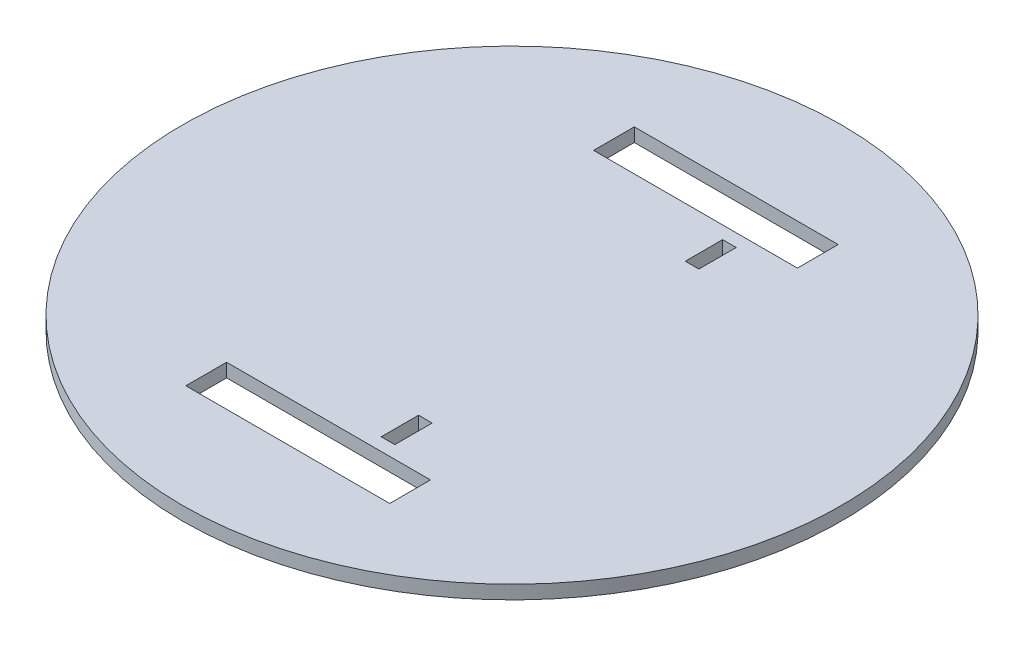
ISO-10303-21;
HEADER;
FILE_DESCRIPTION(('STEP AP214'),'2;1');
FILE_NAME('part.step','',(''),(''),'','','');
FILE_SCHEMA(('AUTOMOTIVE_DESIGN { 1 0 10303 214 1 1 1 1 }'));
ENDSEC;
DATA;
#1=APPLICATION_CONTEXT('core data for automotive mechanical design processes');
#2=APPLICATION_PROTOCOL_DEFINITION('international standard','automotive_design',2000,#1);
#3=PRODUCT_CONTEXT('',#1,'mechanical');
#4=PRODUCT('Part','Part','',(#3));
#5=PRODUCT_RELATED_PRODUCT_CATEGORY('part','',(#4));
#6=PRODUCT_DEFINITION_FORMATION('','',#4);
#7=PRODUCT_DEFINITION_CONTEXT('part definition',#1,'design');
#8=PRODUCT_DEFINITION('design','',#6,#7);
#9=PRODUCT_DEFINITION_SHAPE('','',#8);
#10=(LENGTH_UNIT() NAMED_UNIT(*) SI_UNIT(.MILLI.,.METRE.));
#11=(NAMED_UNIT(*) PLANE_ANGLE_UNIT() SI_UNIT($,.RADIAN.));
#12=(NAMED_UNIT(*) SI_UNIT($,.STERADIAN.) SOLID_ANGLE_UNIT());
#13=UNCERTAINTY_MEASURE_WITH_UNIT(LENGTH_MEASURE(1.E-05),#10,'distance_accuracy_value','');
#14=(GEOMETRIC_REPRESENTATION_CONTEXT(3) GLOBAL_UNCERTAINTY_ASSIGNED_CONTEXT((#13)) GLOBAL_UNIT_ASSIGNED_CONTEXT((#10,
#11,#12)) REPRESENTATION_CONTEXT('',''));
#15=CARTESIAN_POINT('',(0.,0.,0.));
#16=DIRECTION('',(0.,0.,1.));
#17=DIRECTION('',(1.,0.,0.));
#18=AXIS2_PLACEMENT_3D('',#15,#16,#17);
#19=CARTESIAN_POINT('',(0.,4.,0.));
#20=DIRECTION('',(0.,-1.,0.));
#21=DIRECTION('',(0.,0.,-1.));
#22=AXIS2_PLACEMENT_3D('',#19,#20,#21);
#23=CYLINDRICAL_SURFACE('',#22,97.);
#24=CARTESIAN_POINT('',(0.,4.,0.));
#25=DIRECTION('',(0.,1.,0.));
#26=DIRECTION('',(0.,0.,1.));
#27=AXIS2_PLACEMENT_3D('',#24,#25,#26);
#28=CIRCLE('',#27,97.);
#29=CARTESIAN_POINT('',(0.,4.,97.));
#30=VERTEX_POINT('',#29);
#31=EDGE_CURVE('E233',#30,#30,#28,.T.);
#32=ORIENTED_EDGE('',*,*,#31,.F.);
#33=EDGE_LOOP('',(#32));
#34=FACE_BOUND('',#33,.T.);
#35=CARTESIAN_POINT('',(0.,0.,0.));
#36=DIRECTION('',(0.,1.,0.));
#37=DIRECTION('',(0.,0.,1.));
#38=AXIS2_PLACEMENT_3D('',#35,#36,#37);
#39=CIRCLE('',#38,97.);
#40=CARTESIAN_POINT('',(0.,0.,97.));
#41=VERTEX_POINT('',#40);
#42=EDGE_CURVE('E226',#41,#41,#39,.T.);
#43=ORIENTED_EDGE('',*,*,#42,.T.);
#44=EDGE_LOOP('',(#43));
#45=FACE_BOUND('',#44,.T.);
#46=ADVANCED_FACE('F32',(#34,#45),#23,.T.);
#47=CARTESIAN_POINT('',(0.,4.,0.));
#48=DIRECTION('',(0.,1.,0.));
#49=DIRECTION('',(0.,0.,1.));
#50=AXIS2_PLACEMENT_3D('',#47,#48,#49);
#51=PLANE('',#50);
#52=DIRECTION('',(0.,0.,1.));
#53=VECTOR('',#52,1.);
#54=CARTESIAN_POINT('',(11.75,4.,-39.25));
#55=LINE('',#54,#53);
#56=CARTESIAN_POINT('',(11.7499999999999,4.,-50.25));
#57=VERTEX_POINT('',#56);
#58=CARTESIAN_POINT('',(11.75,4.,-39.25));
#59=VERTEX_POINT('',#58);
#60=EDGE_CURVE('E46',#57,#59,#55,.T.);
#61=ORIENTED_EDGE('',*,*,#60,.F.);
#62=DIRECTION('',(-1.,0.,0.));
#63=VECTOR('',#62,1.);
#64=CARTESIAN_POINT('',(11.7499999999999,4.,-50.25));
#65=LINE('',#64,#63);
#66=CARTESIAN_POINT('',(15.7499999999999,4.,-50.25));
#67=VERTEX_POINT('',#66);
#68=EDGE_CURVE('E163',#67,#57,#65,.T.);
#69=ORIENTED_EDGE('',*,*,#68,.F.);
#70=DIRECTION('',(0.,0.,-1.));
#71=VECTOR('',#70,1.);
#72=CARTESIAN_POINT('',(15.75,4.,-39.25));
#73=LINE('',#72,#71);
#74=CARTESIAN_POINT('',(15.75,4.,-39.25));
#75=VERTEX_POINT('',#74);
#76=EDGE_CURVE('E147',#75,#67,#73,.T.);
#77=ORIENTED_EDGE('',*,*,#76,.F.);
#78=DIRECTION('',(1.,0.,0.));
#79=VECTOR('',#78,1.);
#80=CARTESIAN_POINT('',(11.75,4.,-39.25));
#81=LINE('',#80,#79);
#82=EDGE_CURVE('E156',#59,#75,#81,.T.);
#83=ORIENTED_EDGE('',*,*,#82,.F.);
#84=EDGE_LOOP('',(#61,#69,#77,#83));
#85=FACE_BOUND('',#84,.T.);
#86=DIRECTION('',(0.,0.,-1.));
#87=VECTOR('',#86,1.);
#88=CARTESIAN_POINT('',(15.75,4.,39.25));
#89=LINE('',#88,#87);
#90=CARTESIAN_POINT('',(15.75,4.,50.25));
#91=VERTEX_POINT('',#90);
#92=CARTESIAN_POINT('',(15.75,4.,39.25));
#93=VERTEX_POINT('',#92);
#94=EDGE_CURVE('E170',#91,#93,#89,.T.);
#95=ORIENTED_EDGE('',*,*,#94,.F.);
#96=DIRECTION('',(1.,0.,0.));
#97=VECTOR('',#96,1.);
#98=CARTESIAN_POINT('',(11.75,4.,50.25));
#99=LINE('',#98,#97);
#100=CARTESIAN_POINT('',(11.75,4.,50.25));
#101=VERTEX_POINT('',#100);
#102=EDGE_CURVE('E180',#101,#91,#99,.T.);
#103=ORIENTED_EDGE('',*,*,#102,.F.);
#104=DIRECTION('',(0.,0.,1.));
#105=VECTOR('',#104,1.);
#106=CARTESIAN_POINT('',(11.75,4.,39.25));
#107=LINE('',#106,#105);
#108=CARTESIAN_POINT('',(11.75,4.,39.25));
#109=VERTEX_POINT('',#108);
#110=EDGE_CURVE('E177',#109,#101,#107,.T.);
#111=ORIENTED_EDGE('',*,*,#110,.F.);
#112=DIRECTION('',(-1.,0.,0.));
#113=VECTOR('',#112,1.);
#114=CARTESIAN_POINT('',(11.75,4.,39.25));
#115=LINE('',#114,#113);
#116=EDGE_CURVE('E174',#93,#109,#115,.T.);
#117=ORIENTED_EDGE('',*,*,#116,.F.);
#118=EDGE_LOOP('',(#95,#103,#111,#117));
#119=FACE_BOUND('',#118,.T.);
#120=DIRECTION('',(0.,0.,-1.));
#121=VECTOR('',#120,1.);
#122=CARTESIAN_POINT('',(30.,4.,-66.));
#123=LINE('',#122,#121);
#124=CARTESIAN_POINT('',(30.,4.,-54.));
#125=VERTEX_POINT('',#124);
#126=CARTESIAN_POINT('',(30.,4.,-66.));
#127=VERTEX_POINT('',#126);
#128=EDGE_CURVE('E186',#125,#127,#123,.T.);
#129=ORIENTED_EDGE('',*,*,#128,.F.);
#130=DIRECTION('',(1.,0.,0.));
#131=VECTOR('',#130,1.);
#132=CARTESIAN_POINT('',(-30.,4.,-54.));
#133=LINE('',#132,#131);
#134=CARTESIAN_POINT('',(-30.,4.,-54.));
#135=VERTEX_POINT('',#134);
#136=EDGE_CURVE('E200',#135,#125,#133,.T.);
#137=ORIENTED_EDGE('',*,*,#136,.F.);
#138=DIRECTION('',(0.,0.,1.));
#139=VECTOR('',#138,1.);
#140=CARTESIAN_POINT('',(-30.,4.,-66.));
#141=LINE('',#140,#139);
#142=CARTESIAN_POINT('',(-30.,4.,-66.));
#143=VERTEX_POINT('',#142);
#144=EDGE_CURVE('E197',#143,#135,#141,.T.);
#145=ORIENTED_EDGE('',*,*,#144,.F.);
#146=DIRECTION('',(-1.,0.,0.));
#147=VECTOR('',#146,1.);
#148=CARTESIAN_POINT('',(-30.,4.,-66.));
#149=LINE('',#148,#147);
#150=EDGE_CURVE('E194',#127,#143,#149,.T.);
#151=ORIENTED_EDGE('',*,*,#150,.F.);
#152=EDGE_LOOP('',(#129,#137,#145,#151));
#153=FACE_BOUND('',#152,.T.);
#154=DIRECTION('',(0.,0.,-1.));
#155=VECTOR('',#154,1.);
#156=CARTESIAN_POINT('',(30.,4.,54.));
#157=LINE('',#156,#155);
#158=CARTESIAN_POINT('',(30.,4.,66.));
#159=VERTEX_POINT('',#158);
#160=CARTESIAN_POINT('',(30.,4.,54.));
#161=VERTEX_POINT('',#160);
#162=EDGE_CURVE('E206',#159,#161,#157,.T.);
#163=ORIENTED_EDGE('',*,*,#162,.F.);
#164=DIRECTION('',(1.,0.,0.));
#165=VECTOR('',#164,1.);
#166=CARTESIAN_POINT('',(-30.,4.,66.));
#167=LINE('',#166,#165);
#168=CARTESIAN_POINT('',(-30.,4.,66.));
#169=VERTEX_POINT('',#168);
#170=EDGE_CURVE('E220',#169,#159,#167,.T.);
#171=ORIENTED_EDGE('',*,*,#170,.F.);
#172=DIRECTION('',(0.,0.,1.));
#173=VECTOR('',#172,1.);
#174=CARTESIAN_POINT('',(-30.,4.,54.));
#175=LINE('',#174,#173);
#176=CARTESIAN_POINT('',(-30.,4.,54.));
#177=VERTEX_POINT('',#176);
#178=EDGE_CURVE('E217',#177,#169,#175,.T.);
#179=ORIENTED_EDGE('',*,*,#178,.F.);
#180=DIRECTION('',(-1.,0.,0.));
#181=VECTOR('',#180,1.);
#182=CARTESIAN_POINT('',(-30.,4.,54.));
#183=LINE('',#182,#181);
#184=EDGE_CURVE('E214',#161,#177,#183,.T.);
#185=ORIENTED_EDGE('',*,*,#184,.F.);
#186=EDGE_LOOP('',(#163,#171,#179,#185));
#187=FACE_BOUND('',#186,.T.);
#188=ORIENTED_EDGE('',*,*,#31,.T.);
#189=EDGE_LOOP('',(#188));
#190=FACE_BOUND('',#189,.T.);
#191=ADVANCED_FACE('F160',(#85,#119,#153,#187,#190),#51,.T.);
#192=CARTESIAN_POINT('',(0.,0.,0.));
#193=DIRECTION('',(0.,1.,0.));
#194=DIRECTION('',(0.,0.,1.));
#195=AXIS2_PLACEMENT_3D('',#192,#193,#194);
#196=PLANE('',#195);
#197=DIRECTION('',(-1.,0.,0.));
#198=VECTOR('',#197,1.);
#199=CARTESIAN_POINT('',(0.,0.,-50.25));
#200=LINE('',#199,#198);
#201=CARTESIAN_POINT('',(15.7499999999999,0.,-50.25));
#202=VERTEX_POINT('',#201);
#203=CARTESIAN_POINT('',(11.7499999999999,0.,-50.25));
#204=VERTEX_POINT('',#203);
#205=EDGE_CURVE('E39',#202,#204,#200,.T.);
#206=ORIENTED_EDGE('',*,*,#205,.T.);
#207=DIRECTION('',(0.,0.,1.));
#208=VECTOR('',#207,1.);
#209=CARTESIAN_POINT('',(11.7500000000002,0.,0.));
#210=LINE('',#209,#208);
#211=CARTESIAN_POINT('',(11.75,0.,-39.25));
#212=VERTEX_POINT('',#211);
#213=EDGE_CURVE('E11',#204,#212,#210,.T.);
#214=ORIENTED_EDGE('',*,*,#213,.T.);
#215=DIRECTION('',(1.,0.,0.));
#216=VECTOR('',#215,1.);
#217=CARTESIAN_POINT('',(0.,0.,-39.25));
#218=LINE('',#217,#216);
#219=CARTESIAN_POINT('',(15.75,0.,-39.25));
#220=VERTEX_POINT('',#219);
#221=EDGE_CURVE('E274',#212,#220,#218,.T.);
#222=ORIENTED_EDGE('',*,*,#221,.T.);
#223=DIRECTION('',(0.,0.,-1.));
#224=VECTOR('',#223,1.);
#225=CARTESIAN_POINT('',(15.7500000000002,0.,0.));
#226=LINE('',#225,#224);
#227=EDGE_CURVE('E150',#220,#202,#226,.T.);
#228=ORIENTED_EDGE('',*,*,#227,.T.);
#229=EDGE_LOOP('',(#206,#214,#222,#228));
#230=FACE_BOUND('',#229,.T.);
#231=DIRECTION('',(1.,0.,0.));
#232=VECTOR('',#231,1.);
#233=CARTESIAN_POINT('',(0.,0.,50.25));
#234=LINE('',#233,#232);
#235=CARTESIAN_POINT('',(11.75,0.,50.25));
#236=VERTEX_POINT('',#235);
#237=CARTESIAN_POINT('',(15.75,0.,50.25));
#238=VERTEX_POINT('',#237);
#239=EDGE_CURVE('E268',#236,#238,#234,.T.);
#240=ORIENTED_EDGE('',*,*,#239,.T.);
#241=DIRECTION('',(0.,0.,-1.));
#242=VECTOR('',#241,1.);
#243=CARTESIAN_POINT('',(15.75,0.,0.));
#244=LINE('',#243,#242);
#245=CARTESIAN_POINT('',(15.75,0.,39.25));
#246=VERTEX_POINT('',#245);
#247=EDGE_CURVE('E271',#238,#246,#244,.T.);
#248=ORIENTED_EDGE('',*,*,#247,.T.);
#249=DIRECTION('',(-1.,0.,0.));
#250=VECTOR('',#249,1.);
#251=CARTESIAN_POINT('',(0.,0.,39.25));
#252=LINE('',#251,#250);
#253=CARTESIAN_POINT('',(11.75,0.,39.25));
#254=VERTEX_POINT('',#253);
#255=EDGE_CURVE('E262',#246,#254,#252,.T.);
#256=ORIENTED_EDGE('',*,*,#255,.T.);
#257=DIRECTION('',(0.,0.,1.));
#258=VECTOR('',#257,1.);
#259=CARTESIAN_POINT('',(11.75,0.,0.));
#260=LINE('',#259,#258);
#261=EDGE_CURVE('E265',#254,#236,#260,.T.);
#262=ORIENTED_EDGE('',*,*,#261,.T.);
#263=EDGE_LOOP('',(#240,#248,#256,#262));
#264=FACE_BOUND('',#263,.T.);
#265=DIRECTION('',(1.,0.,0.));
#266=VECTOR('',#265,1.);
#267=CARTESIAN_POINT('',(0.,0.,-54.));
#268=LINE('',#267,#266);
#269=CARTESIAN_POINT('',(-30.,0.,-54.));
#270=VERTEX_POINT('',#269);
#271=CARTESIAN_POINT('',(30.,0.,-54.));
#272=VERTEX_POINT('',#271);
#273=EDGE_CURVE('E256',#270,#272,#268,.T.);
#274=ORIENTED_EDGE('',*,*,#273,.T.);
#275=DIRECTION('',(0.,0.,-1.));
#276=VECTOR('',#275,1.);
#277=CARTESIAN_POINT('',(30.,0.,0.));
#278=LINE('',#277,#276);
#279=CARTESIAN_POINT('',(30.,0.,-66.));
#280=VERTEX_POINT('',#279);
#281=EDGE_CURVE('E259',#272,#280,#278,.T.);
#282=ORIENTED_EDGE('',*,*,#281,.T.);
#283=DIRECTION('',(-1.,0.,0.));
#284=VECTOR('',#283,1.);
#285=CARTESIAN_POINT('',(0.,0.,-66.));
#286=LINE('',#285,#284);
#287=CARTESIAN_POINT('',(-30.,0.,-66.));
#288=VERTEX_POINT('',#287);
#289=EDGE_CURVE('E250',#280,#288,#286,.T.);
#290=ORIENTED_EDGE('',*,*,#289,.T.);
#291=DIRECTION('',(0.,0.,1.));
#292=VECTOR('',#291,1.);
#293=CARTESIAN_POINT('',(-30.,0.,0.));
#294=LINE('',#293,#292);
#295=EDGE_CURVE('E253',#288,#270,#294,.T.);
#296=ORIENTED_EDGE('',*,*,#295,.T.);
#297=EDGE_LOOP('',(#274,#282,#290,#296));
#298=FACE_BOUND('',#297,.T.);
#299=DIRECTION('',(1.,0.,0.));
#300=VECTOR('',#299,1.);
#301=CARTESIAN_POINT('',(0.,0.,66.));
#302=LINE('',#301,#300);
#303=CARTESIAN_POINT('',(-30.,0.,66.));
#304=VERTEX_POINT('',#303);
#305=CARTESIAN_POINT('',(30.,0.,66.));
#306=VERTEX_POINT('',#305);
#307=EDGE_CURVE('E244',#304,#306,#302,.T.);
#308=ORIENTED_EDGE('',*,*,#307,.T.);
#309=DIRECTION('',(0.,0.,-1.));
#310=VECTOR('',#309,1.);
#311=CARTESIAN_POINT('',(30.,0.,0.));
#312=LINE('',#311,#310);
#313=CARTESIAN_POINT('',(30.,0.,54.));
#314=VERTEX_POINT('',#313);
#315=EDGE_CURVE('E247',#306,#314,#312,.T.);
#316=ORIENTED_EDGE('',*,*,#315,.T.);
#317=DIRECTION('',(-1.,0.,0.));
#318=VECTOR('',#317,1.);
#319=CARTESIAN_POINT('',(0.,0.,54.));
#320=LINE('',#319,#318);
#321=CARTESIAN_POINT('',(-30.,0.,54.));
#322=VERTEX_POINT('',#321);
#323=EDGE_CURVE('E236',#314,#322,#320,.T.);
#324=ORIENTED_EDGE('',*,*,#323,.T.);
#325=DIRECTION('',(0.,0.,1.));
#326=VECTOR('',#325,1.);
#327=CARTESIAN_POINT('',(-30.,0.,0.));
#328=LINE('',#327,#326);
#329=EDGE_CURVE('E241',#322,#304,#328,.T.);
#330=ORIENTED_EDGE('',*,*,#329,.T.);
#331=EDGE_LOOP('',(#308,#316,#324,#330));
#332=FACE_BOUND('',#331,.T.);
#333=ORIENTED_EDGE('',*,*,#42,.F.);
#334=EDGE_LOOP('',(#333));
#335=FACE_BOUND('',#334,.T.);
#336=ADVANCED_FACE('F278',(#230,#264,#298,#332,#335),#196,.F.);
#337=CARTESIAN_POINT('',(30.,-6.,54.));
#338=DIRECTION('',(1.,0.,0.));
#339=DIRECTION('',(0.,0.,-1.));
#340=AXIS2_PLACEMENT_3D('',#337,#338,#339);
#341=PLANE('',#340);
#342=DIRECTION('',(0.,1.,0.));
#343=VECTOR('',#342,1.);
#344=CARTESIAN_POINT('',(30.,-6.,66.));
#345=LINE('',#344,#343);
#346=EDGE_CURVE('E224',#306,#159,#345,.T.);
#347=ORIENTED_EDGE('',*,*,#346,.T.);
#348=ORIENTED_EDGE('',*,*,#162,.T.);
#349=DIRECTION('',(0.,1.,0.));
#350=VECTOR('',#349,1.);
#351=CARTESIAN_POINT('',(30.,-6.,54.));
#352=LINE('',#351,#350);
#353=EDGE_CURVE('E223',#314,#161,#352,.T.);
#354=ORIENTED_EDGE('',*,*,#353,.F.);
#355=ORIENTED_EDGE('',*,*,#315,.F.);
#356=EDGE_LOOP('',(#347,#348,#354,#355));
#357=FACE_BOUND('',#356,.T.);
#358=ADVANCED_FACE('F309',(#357),#341,.F.);
#359=CARTESIAN_POINT('',(-30.,-6.,66.));
#360=DIRECTION('',(0.,0.,1.));
#361=DIRECTION('',(1.,0.,0.));
#362=AXIS2_PLACEMENT_3D('',#359,#360,#361);
#363=PLANE('',#362);
#364=DIRECTION('',(0.,1.,0.));
#365=VECTOR('',#364,1.);
#366=CARTESIAN_POINT('',(-30.,-6.,66.));
#367=LINE('',#366,#365);
#368=EDGE_CURVE('E227',#304,#169,#367,.T.);
#369=ORIENTED_EDGE('',*,*,#368,.T.);
#370=ORIENTED_EDGE('',*,*,#170,.T.);
#371=ORIENTED_EDGE('',*,*,#346,.F.);
#372=ORIENTED_EDGE('',*,*,#307,.F.);
#373=EDGE_LOOP('',(#369,#370,#371,#372));
#374=FACE_BOUND('',#373,.T.);
#375=ADVANCED_FACE('F314',(#374),#363,.F.);
#376=CARTESIAN_POINT('',(-30.,-6.,54.));
#377=DIRECTION('',(-1.,0.,0.));
#378=DIRECTION('',(0.,0.,1.));
#379=AXIS2_PLACEMENT_3D('',#376,#377,#378);
#380=PLANE('',#379);
#381=DIRECTION('',(0.,1.,0.));
#382=VECTOR('',#381,1.);
#383=CARTESIAN_POINT('',(-30.,-6.,54.));
#384=LINE('',#383,#382);
#385=EDGE_CURVE('E229',#322,#177,#384,.T.);
#386=ORIENTED_EDGE('',*,*,#385,.T.);
#387=ORIENTED_EDGE('',*,*,#178,.T.);
#388=ORIENTED_EDGE('',*,*,#368,.F.);
#389=ORIENTED_EDGE('',*,*,#329,.F.);
#390=EDGE_LOOP('',(#386,#387,#388,#389));
#391=FACE_BOUND('',#390,.T.);
#392=ADVANCED_FACE('F322',(#391),#380,.F.);
#393=CARTESIAN_POINT('',(-30.,-6.,54.));
#394=DIRECTION('',(0.,0.,-1.));
#395=DIRECTION('',(-1.,0.,0.));
#396=AXIS2_PLACEMENT_3D('',#393,#394,#395);
#397=PLANE('',#396);
#398=ORIENTED_EDGE('',*,*,#353,.T.);
#399=ORIENTED_EDGE('',*,*,#184,.T.);
#400=ORIENTED_EDGE('',*,*,#385,.F.);
#401=ORIENTED_EDGE('',*,*,#323,.F.);
#402=EDGE_LOOP('',(#398,#399,#400,#401));
#403=FACE_BOUND('',#402,.T.);
#404=ADVANCED_FACE('F318',(#403),#397,.F.);
#405=CARTESIAN_POINT('',(30.,-6.,-66.));
#406=DIRECTION('',(1.,0.,0.));
#407=DIRECTION('',(0.,0.,-1.));
#408=AXIS2_PLACEMENT_3D('',#405,#406,#407);
#409=PLANE('',#408);
#410=DIRECTION('',(0.,1.,0.));
#411=VECTOR('',#410,1.);
#412=CARTESIAN_POINT('',(30.,-6.,-54.));
#413=LINE('',#412,#411);
#414=EDGE_CURVE('E204',#272,#125,#413,.T.);
#415=ORIENTED_EDGE('',*,*,#414,.T.);
#416=ORIENTED_EDGE('',*,*,#128,.T.);
#417=DIRECTION('',(0.,1.,0.));
#418=VECTOR('',#417,1.);
#419=CARTESIAN_POINT('',(30.,-6.,-66.));
#420=LINE('',#419,#418);
#421=EDGE_CURVE('E203',#280,#127,#420,.T.);
#422=ORIENTED_EDGE('',*,*,#421,.F.);
#423=ORIENTED_EDGE('',*,*,#281,.F.);
#424=EDGE_LOOP('',(#415,#416,#422,#423));
#425=FACE_BOUND('',#424,.T.);
#426=ADVANCED_FACE('F321',(#425),#409,.F.);
#427=CARTESIAN_POINT('',(-30.,-6.,-54.));
#428=DIRECTION('',(0.,0.,1.));
#429=DIRECTION('',(1.,0.,0.));
#430=AXIS2_PLACEMENT_3D('',#427,#428,#429);
#431=PLANE('',#430);
#432=DIRECTION('',(0.,1.,0.));
#433=VECTOR('',#432,1.);
#434=CARTESIAN_POINT('',(-30.,-6.,-54.));
#435=LINE('',#434,#433);
#436=EDGE_CURVE('E207',#270,#135,#435,.T.);
#437=ORIENTED_EDGE('',*,*,#436,.T.);
#438=ORIENTED_EDGE('',*,*,#136,.T.);
#439=ORIENTED_EDGE('',*,*,#414,.F.);
#440=ORIENTED_EDGE('',*,*,#273,.F.);
#441=EDGE_LOOP('',(#437,#438,#439,#440));
#442=FACE_BOUND('',#441,.T.);
#443=ADVANCED_FACE('F332',(#442),#431,.F.);
#444=CARTESIAN_POINT('',(-30.,-6.,-66.));
#445=DIRECTION('',(-1.,0.,0.));
#446=DIRECTION('',(0.,0.,1.));
#447=AXIS2_PLACEMENT_3D('',#444,#445,#446);
#448=PLANE('',#447);
#449=DIRECTION('',(0.,1.,0.));
#450=VECTOR('',#449,1.);
#451=CARTESIAN_POINT('',(-30.,-6.,-66.));
#452=LINE('',#451,#450);
#453=EDGE_CURVE('E209',#288,#143,#452,.T.);
#454=ORIENTED_EDGE('',*,*,#453,.T.);
#455=ORIENTED_EDGE('',*,*,#144,.T.);
#456=ORIENTED_EDGE('',*,*,#436,.F.);
#457=ORIENTED_EDGE('',*,*,#295,.F.);
#458=EDGE_LOOP('',(#454,#455,#456,#457));
#459=FACE_BOUND('',#458,.T.);
#460=ADVANCED_FACE('F338',(#459),#448,.F.);
#461=CARTESIAN_POINT('',(-30.,-6.,-66.));
#462=DIRECTION('',(0.,0.,-1.));
#463=DIRECTION('',(-1.,0.,0.));
#464=AXIS2_PLACEMENT_3D('',#461,#462,#463);
#465=PLANE('',#464);
#466=ORIENTED_EDGE('',*,*,#421,.T.);
#467=ORIENTED_EDGE('',*,*,#150,.T.);
#468=ORIENTED_EDGE('',*,*,#453,.F.);
#469=ORIENTED_EDGE('',*,*,#289,.F.);
#470=EDGE_LOOP('',(#466,#467,#468,#469));
#471=FACE_BOUND('',#470,.T.);
#472=ADVANCED_FACE('F334',(#471),#465,.F.);
#473=CARTESIAN_POINT('',(15.75,-6.,39.25));
#474=DIRECTION('',(1.,0.,0.));
#475=DIRECTION('',(0.,0.,-1.));
#476=AXIS2_PLACEMENT_3D('',#473,#474,#475);
#477=PLANE('',#476);
#478=DIRECTION('',(0.,1.,0.));
#479=VECTOR('',#478,1.);
#480=CARTESIAN_POINT('',(15.75,-6.,50.25));
#481=LINE('',#480,#479);
#482=EDGE_CURVE('E184',#238,#91,#481,.T.);
#483=ORIENTED_EDGE('',*,*,#482,.T.);
#484=ORIENTED_EDGE('',*,*,#94,.T.);
#485=DIRECTION('',(0.,1.,0.));
#486=VECTOR('',#485,1.);
#487=CARTESIAN_POINT('',(15.75,-6.,39.25));
#488=LINE('',#487,#486);
#489=EDGE_CURVE('E183',#246,#93,#488,.T.);
#490=ORIENTED_EDGE('',*,*,#489,.F.);
#491=ORIENTED_EDGE('',*,*,#247,.F.);
#492=EDGE_LOOP('',(#483,#484,#490,#491));
#493=FACE_BOUND('',#492,.T.);
#494=ADVANCED_FACE('F337',(#493),#477,.F.);
#495=CARTESIAN_POINT('',(11.75,-6.,50.25));
#496=DIRECTION('',(0.,0.,1.));
#497=DIRECTION('',(1.,0.,0.));
#498=AXIS2_PLACEMENT_3D('',#495,#496,#497);
#499=PLANE('',#498);
#500=DIRECTION('',(0.,1.,0.));
#501=VECTOR('',#500,1.);
#502=CARTESIAN_POINT('',(11.75,-6.,50.25));
#503=LINE('',#502,#501);
#504=EDGE_CURVE('E187',#236,#101,#503,.T.);
#505=ORIENTED_EDGE('',*,*,#504,.T.);
#506=ORIENTED_EDGE('',*,*,#102,.T.);
#507=ORIENTED_EDGE('',*,*,#482,.F.);
#508=ORIENTED_EDGE('',*,*,#239,.F.);
#509=EDGE_LOOP('',(#505,#506,#507,#508));
#510=FACE_BOUND('',#509,.T.);
#511=ADVANCED_FACE('F347',(#510),#499,.F.);
#512=CARTESIAN_POINT('',(11.75,-6.,39.25));
#513=DIRECTION('',(-1.,0.,0.));
#514=DIRECTION('',(0.,0.,1.));
#515=AXIS2_PLACEMENT_3D('',#512,#513,#514);
#516=PLANE('',#515);
#517=DIRECTION('',(0.,1.,0.));
#518=VECTOR('',#517,1.);
#519=CARTESIAN_POINT('',(11.75,-6.,39.25));
#520=LINE('',#519,#518);
#521=EDGE_CURVE('E189',#254,#109,#520,.T.);
#522=ORIENTED_EDGE('',*,*,#521,.T.);
#523=ORIENTED_EDGE('',*,*,#110,.T.);
#524=ORIENTED_EDGE('',*,*,#504,.F.);
#525=ORIENTED_EDGE('',*,*,#261,.F.);
#526=EDGE_LOOP('',(#522,#523,#524,#525));
#527=FACE_BOUND('',#526,.T.);
#528=ADVANCED_FACE('F292',(#527),#516,.F.);
#529=CARTESIAN_POINT('',(11.75,-6.,39.25));
#530=DIRECTION('',(0.,0.,-1.));
#531=DIRECTION('',(-1.,0.,0.));
#532=AXIS2_PLACEMENT_3D('',#529,#530,#531);
#533=PLANE('',#532);
#534=ORIENTED_EDGE('',*,*,#489,.T.);
#535=ORIENTED_EDGE('',*,*,#116,.T.);
#536=ORIENTED_EDGE('',*,*,#521,.F.);
#537=ORIENTED_EDGE('',*,*,#255,.F.);
#538=EDGE_LOOP('',(#534,#535,#536,#537));
#539=FACE_BOUND('',#538,.T.);
#540=ADVANCED_FACE('F285',(#539),#533,.F.);
#541=CARTESIAN_POINT('',(11.75,-6.,-39.25));
#542=DIRECTION('',(-1.,0.,0.));
#543=DIRECTION('',(0.,0.,1.));
#544=AXIS2_PLACEMENT_3D('',#541,#542,#543);
#545=PLANE('',#544);
#546=DIRECTION('',(0.,1.,0.));
#547=VECTOR('',#546,1.);
#548=CARTESIAN_POINT('',(11.7499999999999,-6.,-50.25));
#549=LINE('',#548,#547);
#550=EDGE_CURVE('E168',#204,#57,#549,.T.);
#551=ORIENTED_EDGE('',*,*,#550,.T.);
#552=ORIENTED_EDGE('',*,*,#60,.T.);
#553=DIRECTION('',(0.,1.,0.));
#554=VECTOR('',#553,1.);
#555=CARTESIAN_POINT('',(11.75,-6.,-39.25));
#556=LINE('',#555,#554);
#557=EDGE_CURVE('E153',#212,#59,#556,.T.);
#558=ORIENTED_EDGE('',*,*,#557,.F.);
#559=ORIENTED_EDGE('',*,*,#213,.F.);
#560=EDGE_LOOP('',(#551,#552,#558,#559));
#561=FACE_BOUND('',#560,.T.);
#562=ADVANCED_FACE('F283',(#561),#545,.F.);
#563=CARTESIAN_POINT('',(11.7499999999999,-6.,-50.25));
#564=DIRECTION('',(0.,0.,-1.));
#565=DIRECTION('',(-1.,0.,0.));
#566=AXIS2_PLACEMENT_3D('',#563,#564,#565);
#567=PLANE('',#566);
#568=DIRECTION('',(0.,1.,0.));
#569=VECTOR('',#568,1.);
#570=CARTESIAN_POINT('',(15.7499999999999,-6.,-50.25));
#571=LINE('',#570,#569);
#572=EDGE_CURVE('E152',#202,#67,#571,.T.);
#573=ORIENTED_EDGE('',*,*,#572,.T.);
#574=ORIENTED_EDGE('',*,*,#68,.T.);
#575=ORIENTED_EDGE('',*,*,#550,.F.);
#576=ORIENTED_EDGE('',*,*,#205,.F.);
#577=EDGE_LOOP('',(#573,#574,#575,#576));
#578=FACE_BOUND('',#577,.T.);
#579=ADVANCED_FACE('F282',(#578),#567,.F.);
#580=CARTESIAN_POINT('',(15.75,-6.,-39.25));
#581=DIRECTION('',(1.,0.,0.));
#582=DIRECTION('',(0.,0.,-1.));
#583=AXIS2_PLACEMENT_3D('',#580,#581,#582);
#584=PLANE('',#583);
#585=DIRECTION('',(0.,1.,0.));
#586=VECTOR('',#585,1.);
#587=CARTESIAN_POINT('',(15.75,-6.,-39.25));
#588=LINE('',#587,#586);
#589=EDGE_CURVE('E54',#220,#75,#588,.T.);
#590=ORIENTED_EDGE('',*,*,#589,.T.);
#591=ORIENTED_EDGE('',*,*,#76,.T.);
#592=ORIENTED_EDGE('',*,*,#572,.F.);
#593=ORIENTED_EDGE('',*,*,#227,.F.);
#594=EDGE_LOOP('',(#590,#591,#592,#593));
#595=FACE_BOUND('',#594,.T.);
#596=ADVANCED_FACE('F144',(#595),#584,.F.);
#597=CARTESIAN_POINT('',(11.75,-6.,-39.25));
#598=DIRECTION('',(0.,0.,1.));
#599=DIRECTION('',(1.,0.,0.));
#600=AXIS2_PLACEMENT_3D('',#597,#598,#599);
#601=PLANE('',#600);
#602=ORIENTED_EDGE('',*,*,#557,.T.);
#603=ORIENTED_EDGE('',*,*,#82,.T.);
#604=ORIENTED_EDGE('',*,*,#589,.F.);
#605=ORIENTED_EDGE('',*,*,#221,.F.);
#606=EDGE_LOOP('',(#602,#603,#604,#605));
#607=FACE_BOUND('',#606,.T.);
#608=ADVANCED_FACE('F157',(#607),#601,.F.);
#609=CLOSED_SHELL('',(#46,#191,#336,#358,#375,#392,#404,#426,#443,#460,#472,#494,#511,#528,#540,
#562,#579,#596,#608));
#610=MANIFOLD_SOLID_BREP('B2',#609);
#611=ADVANCED_BREP_SHAPE_REPRESENTATION('',(#18,#610),#14);
#612=SHAPE_DEFINITION_REPRESENTATION(#9,#611);
ENDSEC;
END-ISO-10303-21;
